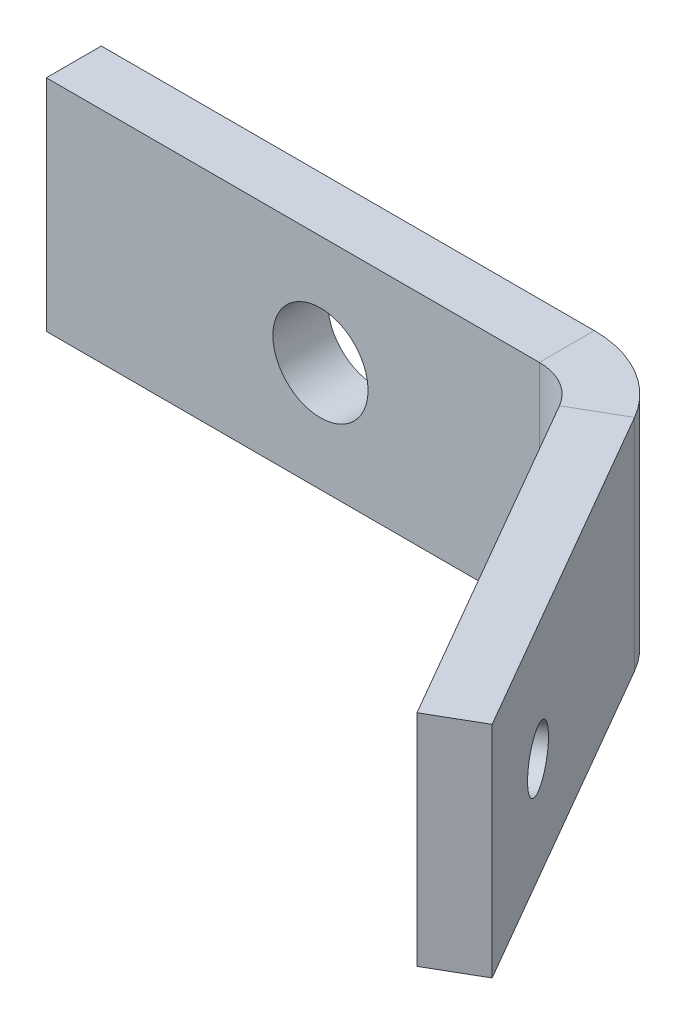
ISO-10303-21;
HEADER;
FILE_DESCRIPTION(('STEP AP214'),'2;1');
FILE_NAME('part.step','',(''),(''),'','','');
FILE_SCHEMA(('AUTOMOTIVE_DESIGN { 1 0 10303 214 1 1 1 1 }'));
ENDSEC;
DATA;
#1=APPLICATION_CONTEXT('core data for automotive mechanical design processes');
#2=APPLICATION_PROTOCOL_DEFINITION('international standard','automotive_design',2000,#1);
#3=PRODUCT_CONTEXT('',#1,'mechanical');
#4=PRODUCT('Part','Part','',(#3));
#5=PRODUCT_RELATED_PRODUCT_CATEGORY('part','',(#4));
#6=PRODUCT_DEFINITION_FORMATION('','',#4);
#7=PRODUCT_DEFINITION_CONTEXT('part definition',#1,'design');
#8=PRODUCT_DEFINITION('design','',#6,#7);
#9=PRODUCT_DEFINITION_SHAPE('','',#8);
#10=(LENGTH_UNIT() NAMED_UNIT(*) SI_UNIT(.MILLI.,.METRE.));
#11=(NAMED_UNIT(*) PLANE_ANGLE_UNIT() SI_UNIT($,.RADIAN.));
#12=(NAMED_UNIT(*) SI_UNIT($,.STERADIAN.) SOLID_ANGLE_UNIT());
#13=UNCERTAINTY_MEASURE_WITH_UNIT(LENGTH_MEASURE(1.E-05),#10,'distance_accuracy_value','');
#14=(GEOMETRIC_REPRESENTATION_CONTEXT(3) GLOBAL_UNCERTAINTY_ASSIGNED_CONTEXT((#13)) GLOBAL_UNIT_ASSIGNED_CONTEXT((#10,
#11,#12)) REPRESENTATION_CONTEXT('',''));
#15=CARTESIAN_POINT('',(0.,0.,0.));
#16=DIRECTION('',(0.,0.,1.));
#17=DIRECTION('',(1.,0.,0.));
#18=AXIS2_PLACEMENT_3D('',#15,#16,#17);
#19=CARTESIAN_POINT('',(0.507611544628694,0.,-3.17103195320263));
#20=DIRECTION('',(0.86602540378444,0.,-0.499999999999998));
#21=DIRECTION('',(-0.499999999999998,0.,-0.86602540378444));
#22=AXIS2_PLACEMENT_3D('',#19,#20,#21);
#23=PLANE('',#22);
#24=CARTESIAN_POINT('',(10.8826115446287,-0.329999999999999,14.7989951753245));
#25=DIRECTION('',(-0.86602540378444,0.,0.499999999999998));
#26=DIRECTION('',(0.499999999999998,0.,0.86602540378444));
#27=AXIS2_PLACEMENT_3D('',#24,#25,#26);
#28=CIRCLE('',#27,1.65000000000001);
#29=CARTESIAN_POINT('',(11.7076115446287,-0.329999999999999,16.2279370915688));
#30=VERTEX_POINT('',#29);
#31=EDGE_CURVE('E198',#30,#30,#28,.T.);
#32=ORIENTED_EDGE('',*,*,#31,.F.);
#33=EDGE_LOOP('',(#32));
#34=FACE_BOUND('',#33,.T.);
#35=DIRECTION('',(-0.499999999999998,0.,-0.86602540378444));
#36=VECTOR('',#35,1.);
#37=CARTESIAN_POINT('',(14.5076115446286,6.35,21.0776793527617));
#38=LINE('',#37,#36);
#39=CARTESIAN_POINT('',(14.5076115446286,6.35,21.0776793527617));
#40=VERTEX_POINT('',#39);
#41=CARTESIAN_POINT('',(3.25639462443063,6.35,1.59000000000001));
#42=VERTEX_POINT('',#41);
#43=EDGE_CURVE('E71',#40,#42,#38,.T.);
#44=ORIENTED_EDGE('',*,*,#43,.T.);
#45=DIRECTION('',(0.,-1.,0.));
#46=VECTOR('',#45,1.);
#47=CARTESIAN_POINT('',(3.25639462443063,0.,1.59));
#48=LINE('',#47,#46);
#49=CARTESIAN_POINT('',(3.25639462443063,-6.35,1.59000000000001));
#50=VERTEX_POINT('',#49);
#51=EDGE_CURVE('E63',#42,#50,#48,.T.);
#52=ORIENTED_EDGE('',*,*,#51,.T.);
#53=DIRECTION('',(0.499999999999998,0.,0.86602540378444));
#54=VECTOR('',#53,1.);
#55=CARTESIAN_POINT('',(14.5076115446286,-6.35,21.0776793527617));
#56=LINE('',#55,#54);
#57=CARTESIAN_POINT('',(14.5076115446286,-6.35,21.0776793527617));
#58=VERTEX_POINT('',#57);
#59=EDGE_CURVE('E79',#50,#58,#56,.T.);
#60=ORIENTED_EDGE('',*,*,#59,.T.);
#61=DIRECTION('',(0.,1.,0.));
#62=VECTOR('',#61,1.);
#63=CARTESIAN_POINT('',(14.5076115446286,6.35,21.0776793527617));
#64=LINE('',#63,#62);
#65=EDGE_CURVE('E170',#58,#40,#64,.T.);
#66=ORIENTED_EDGE('',*,*,#65,.T.);
#67=EDGE_LOOP('',(#44,#52,#60,#66));
#68=FACE_BOUND('',#67,.T.);
#69=ADVANCED_FACE('F54',(#34,#68),#23,.F.);
#70=CARTESIAN_POINT('',(17.2615723286632,6.35,19.4876793527617));
#71=DIRECTION('',(0.,1.,0.));
#72=DIRECTION('',(-0.499999999999998,0.,-0.86602540378444));
#73=AXIS2_PLACEMENT_3D('',#70,#71,#72);
#74=PLANE('',#73);
#75=DIRECTION('',(0.86602540378444,0.,-0.499999999999998));
#76=VECTOR('',#75,1.);
#77=CARTESIAN_POINT('',(6.01035540846515,6.35,0.));
#78=LINE('',#77,#76);
#79=CARTESIAN_POINT('',(6.01035540846515,6.35,0.));
#80=VERTEX_POINT('',#79);
#81=EDGE_CURVE('E14',#42,#80,#78,.T.);
#82=ORIENTED_EDGE('',*,*,#81,.F.);
#83=ORIENTED_EDGE('',*,*,#43,.F.);
#84=DIRECTION('',(-0.86602540378444,0.,0.499999999999998));
#85=VECTOR('',#84,1.);
#86=CARTESIAN_POINT('',(17.2615723286632,6.35,19.4876793527617));
#87=LINE('',#86,#85);
#88=CARTESIAN_POINT('',(17.2615723286632,6.35,19.4876793527617));
#89=VERTEX_POINT('',#88);
#90=EDGE_CURVE('E172',#89,#40,#87,.T.);
#91=ORIENTED_EDGE('',*,*,#90,.F.);
#92=DIRECTION('',(-0.499999999999998,0.,-0.86602540378444));
#93=VECTOR('',#92,1.);
#94=CARTESIAN_POINT('',(17.2615723286632,6.35,19.4876793527617));
#95=LINE('',#94,#93);
#96=EDGE_CURVE('E168',#89,#80,#95,.T.);
#97=ORIENTED_EDGE('',*,*,#96,.T.);
#98=EDGE_LOOP('',(#82,#83,#91,#97));
#99=FACE_BOUND('',#98,.T.);
#100=ADVANCED_FACE('F56',(#99),#74,.T.);
#101=CARTESIAN_POINT('',(17.2615723286632,6.35,19.4876793527617));
#102=DIRECTION('',(0.499999999999998,0.,0.86602540378444));
#103=DIRECTION('',(0.86602540378444,0.,-0.499999999999998));
#104=AXIS2_PLACEMENT_3D('',#101,#102,#103);
#105=PLANE('',#104);
#106=ORIENTED_EDGE('',*,*,#65,.F.);
#107=DIRECTION('',(-0.86602540378444,0.,0.499999999999998));
#108=VECTOR('',#107,1.);
#109=CARTESIAN_POINT('',(17.2615723286632,-6.35,19.4876793527617));
#110=LINE('',#109,#108);
#111=CARTESIAN_POINT('',(17.2615723286632,-6.35,19.4876793527617));
#112=VERTEX_POINT('',#111);
#113=EDGE_CURVE('E174',#112,#58,#110,.T.);
#114=ORIENTED_EDGE('',*,*,#113,.F.);
#115=DIRECTION('',(0.,1.,0.));
#116=VECTOR('',#115,1.);
#117=CARTESIAN_POINT('',(17.2615723286632,6.35,19.4876793527617));
#118=LINE('',#117,#116);
#119=EDGE_CURVE('E165',#112,#89,#118,.T.);
#120=ORIENTED_EDGE('',*,*,#119,.T.);
#121=ORIENTED_EDGE('',*,*,#90,.T.);
#122=EDGE_LOOP('',(#106,#114,#120,#121));
#123=FACE_BOUND('',#122,.T.);
#124=ADVANCED_FACE('F241',(#123),#105,.T.);
#125=CARTESIAN_POINT('',(17.2615723286632,-6.35,19.4876793527617));
#126=DIRECTION('',(0.,-1.,0.));
#127=DIRECTION('',(0.499999999999998,0.,0.86602540378444));
#128=AXIS2_PLACEMENT_3D('',#125,#126,#127);
#129=PLANE('',#128);
#130=DIRECTION('',(-0.86602540378444,0.,0.499999999999998));
#131=VECTOR('',#130,1.);
#132=CARTESIAN_POINT('',(6.01035540846515,-6.35,0.));
#133=LINE('',#132,#131);
#134=CARTESIAN_POINT('',(6.01035540846515,-6.35,0.));
#135=VERTEX_POINT('',#134);
#136=EDGE_CURVE('E177',#135,#50,#133,.T.);
#137=ORIENTED_EDGE('',*,*,#136,.F.);
#138=DIRECTION('',(0.499999999999998,0.,0.86602540378444));
#139=VECTOR('',#138,1.);
#140=CARTESIAN_POINT('',(17.2615723286632,-6.35,19.4876793527617));
#141=LINE('',#140,#139);
#142=EDGE_CURVE('E169',#135,#112,#141,.T.);
#143=ORIENTED_EDGE('',*,*,#142,.T.);
#144=ORIENTED_EDGE('',*,*,#113,.T.);
#145=ORIENTED_EDGE('',*,*,#59,.F.);
#146=EDGE_LOOP('',(#137,#143,#144,#145));
#147=FACE_BOUND('',#146,.T.);
#148=ADVANCED_FACE('F232',(#147),#129,.T.);
#149=CARTESIAN_POINT('',(3.26157232866321,0.,-4.76103195320262));
#150=DIRECTION('',(0.86602540378444,0.,-0.499999999999998));
#151=DIRECTION('',(-0.499999999999998,0.,-0.86602540378444));
#152=AXIS2_PLACEMENT_3D('',#149,#150,#151);
#153=PLANE('',#152);
#154=CARTESIAN_POINT('',(13.6365723286632,-0.329999999999999,13.2089951753245));
#155=DIRECTION('',(0.86602540378444,0.,-0.499999999999998));
#156=DIRECTION('',(-0.499999999999998,0.,-0.86602540378444));
#157=AXIS2_PLACEMENT_3D('',#154,#155,#156);
#158=CIRCLE('',#157,1.65000000000001);
#159=CARTESIAN_POINT('',(12.8115723286632,-0.329999999999999,11.7800532590802));
#160=VERTEX_POINT('',#159);
#161=EDGE_CURVE('E58',#160,#160,#158,.T.);
#162=ORIENTED_EDGE('',*,*,#161,.F.);
#163=EDGE_LOOP('',(#162));
#164=FACE_BOUND('',#163,.T.);
#165=DIRECTION('',(0.,-1.,0.));
#166=VECTOR('',#165,1.);
#167=CARTESIAN_POINT('',(6.01035540846515,0.,0.));
#168=LINE('',#167,#166);
#169=EDGE_CURVE('E143',#80,#135,#168,.T.);
#170=ORIENTED_EDGE('',*,*,#169,.F.);
#171=ORIENTED_EDGE('',*,*,#96,.F.);
#172=ORIENTED_EDGE('',*,*,#119,.F.);
#173=ORIENTED_EDGE('',*,*,#142,.F.);
#174=EDGE_LOOP('',(#170,#171,#172,#173));
#175=FACE_BOUND('',#174,.T.);
#176=ADVANCED_FACE('F224',(#164,#175),#153,.T.);
#177=CARTESIAN_POINT('',(-28.,6.35,-3.18));
#178=DIRECTION('',(-1.,0.,0.));
#179=DIRECTION('',(0.,0.,1.));
#180=AXIS2_PLACEMENT_3D('',#177,#178,#179);
#181=PLANE('',#180);
#182=DIRECTION('',(0.,-1.,0.));
#183=VECTOR('',#182,1.);
#184=CARTESIAN_POINT('',(-28.,6.35,0.));
#185=LINE('',#184,#183);
#186=CARTESIAN_POINT('',(-28.,6.35,0.));
#187=VERTEX_POINT('',#186);
#188=CARTESIAN_POINT('',(-28.,-6.35,0.));
#189=VERTEX_POINT('',#188);
#190=EDGE_CURVE('E211',#187,#189,#185,.T.);
#191=ORIENTED_EDGE('',*,*,#190,.F.);
#192=DIRECTION('',(0.,0.,1.));
#193=VECTOR('',#192,1.);
#194=CARTESIAN_POINT('',(-28.,6.35,-3.18));
#195=LINE('',#194,#193);
#196=CARTESIAN_POINT('',(-28.,6.35,-3.18));
#197=VERTEX_POINT('',#196);
#198=EDGE_CURVE('E183',#197,#187,#195,.T.);
#199=ORIENTED_EDGE('',*,*,#198,.F.);
#200=DIRECTION('',(0.,-1.,0.));
#201=VECTOR('',#200,1.);
#202=CARTESIAN_POINT('',(-28.,6.35,-3.18));
#203=LINE('',#202,#201);
#204=CARTESIAN_POINT('',(-28.,-6.35,-3.18));
#205=VERTEX_POINT('',#204);
#206=EDGE_CURVE('E162',#197,#205,#203,.T.);
#207=ORIENTED_EDGE('',*,*,#206,.T.);
#208=DIRECTION('',(0.,0.,1.));
#209=VECTOR('',#208,1.);
#210=CARTESIAN_POINT('',(-28.,-6.35,-3.18));
#211=LINE('',#210,#209);
#212=EDGE_CURVE('E155',#205,#189,#211,.T.);
#213=ORIENTED_EDGE('',*,*,#212,.T.);
#214=EDGE_LOOP('',(#191,#199,#207,#213));
#215=FACE_BOUND('',#214,.T.);
#216=ADVANCED_FACE('F222',(#215),#181,.T.);
#217=CARTESIAN_POINT('',(0.,0.,-3.18));
#218=DIRECTION('',(0.,0.,-1.));
#219=DIRECTION('',(-1.,0.,0.));
#220=AXIS2_PLACEMENT_3D('',#217,#218,#219);
#221=PLANE('',#220);
#222=CARTESIAN_POINT('',(-12.1509062476857,0.,-3.18));
#223=DIRECTION('',(0.,0.,-1.));
#224=DIRECTION('',(-1.,0.,0.));
#225=AXIS2_PLACEMENT_3D('',#222,#223,#224);
#226=CIRCLE('',#225,2.74999999956231);
#227=CARTESIAN_POINT('',(-14.900906247248,0.,-3.18));
#228=VERTEX_POINT('',#227);
#229=EDGE_CURVE('E188',#228,#228,#226,.T.);
#230=ORIENTED_EDGE('',*,*,#229,.F.);
#231=EDGE_LOOP('',(#230));
#232=FACE_BOUND('',#231,.T.);
#233=DIRECTION('',(-1.,0.,0.));
#234=VECTOR('',#233,1.);
#235=CARTESIAN_POINT('',(28.,6.35,-3.18));
#236=LINE('',#235,#234);
#237=CARTESIAN_POINT('',(0.502433840396107,6.35,-3.18));
#238=VERTEX_POINT('',#237);
#239=EDGE_CURVE('E153',#238,#197,#236,.T.);
#240=ORIENTED_EDGE('',*,*,#239,.F.);
#241=DIRECTION('',(0.,-1.,0.));
#242=VECTOR('',#241,1.);
#243=CARTESIAN_POINT('',(0.502433840396108,0.,-3.18));
#244=LINE('',#243,#242);
#245=CARTESIAN_POINT('',(0.502433840396107,-6.35,-3.18));
#246=VERTEX_POINT('',#245);
#247=EDGE_CURVE('E141',#238,#246,#244,.T.);
#248=ORIENTED_EDGE('',*,*,#247,.T.);
#249=DIRECTION('',(1.,0.,0.));
#250=VECTOR('',#249,1.);
#251=CARTESIAN_POINT('',(28.,-6.35,-3.18));
#252=LINE('',#251,#250);
#253=EDGE_CURVE('E134',#205,#246,#252,.T.);
#254=ORIENTED_EDGE('',*,*,#253,.F.);
#255=ORIENTED_EDGE('',*,*,#206,.F.);
#256=EDGE_LOOP('',(#240,#248,#254,#255));
#257=FACE_BOUND('',#256,.T.);
#258=ADVANCED_FACE('F150',(#232,#257),#221,.T.);
#259=CARTESIAN_POINT('',(28.,-6.35,-3.18));
#260=DIRECTION('',(0.,-1.,0.));
#261=DIRECTION('',(1.,0.,0.));
#262=AXIS2_PLACEMENT_3D('',#259,#260,#261);
#263=PLANE('',#262);
#264=ORIENTED_EDGE('',*,*,#253,.T.);
#265=DIRECTION('',(0.,0.,1.));
#266=VECTOR('',#265,1.);
#267=CARTESIAN_POINT('',(0.502433840396107,-6.35,-3.18));
#268=LINE('',#267,#266);
#269=CARTESIAN_POINT('',(0.502433840396107,-6.35,0.));
#270=VERTEX_POINT('',#269);
#271=EDGE_CURVE('E122',#246,#270,#268,.T.);
#272=ORIENTED_EDGE('',*,*,#271,.T.);
#273=DIRECTION('',(1.,0.,0.));
#274=VECTOR('',#273,1.);
#275=CARTESIAN_POINT('',(28.,-6.35,0.));
#276=LINE('',#275,#274);
#277=EDGE_CURVE('E208',#189,#270,#276,.T.);
#278=ORIENTED_EDGE('',*,*,#277,.F.);
#279=ORIENTED_EDGE('',*,*,#212,.F.);
#280=EDGE_LOOP('',(#264,#272,#278,#279));
#281=FACE_BOUND('',#280,.T.);
#282=ADVANCED_FACE('F157',(#281),#263,.T.);
#283=CARTESIAN_POINT('',(0.,0.,0.));
#284=DIRECTION('',(0.,0.,-1.));
#285=DIRECTION('',(-1.,0.,0.));
#286=AXIS2_PLACEMENT_3D('',#283,#284,#285);
#287=PLANE('',#286);
#288=CARTESIAN_POINT('',(-12.1509062476857,0.,0.));
#289=DIRECTION('',(0.,0.,-1.));
#290=DIRECTION('',(-1.,0.,0.));
#291=AXIS2_PLACEMENT_3D('',#288,#289,#290);
#292=CIRCLE('',#291,2.74999999956231);
#293=CARTESIAN_POINT('',(-14.900906247248,0.,0.));
#294=VERTEX_POINT('',#293);
#295=EDGE_CURVE('E185',#294,#294,#292,.T.);
#296=ORIENTED_EDGE('',*,*,#295,.T.);
#297=EDGE_LOOP('',(#296));
#298=FACE_BOUND('',#297,.T.);
#299=DIRECTION('',(0.,-1.,0.));
#300=VECTOR('',#299,1.);
#301=CARTESIAN_POINT('',(0.502433840396108,0.,0.));
#302=LINE('',#301,#300);
#303=CARTESIAN_POINT('',(0.502433840396108,6.35,0.));
#304=VERTEX_POINT('',#303);
#305=EDGE_CURVE('E144',#304,#270,#302,.T.);
#306=ORIENTED_EDGE('',*,*,#305,.F.);
#307=DIRECTION('',(-1.,0.,0.));
#308=VECTOR('',#307,1.);
#309=CARTESIAN_POINT('',(28.,6.35,0.));
#310=LINE('',#309,#308);
#311=EDGE_CURVE('E133',#304,#187,#310,.T.);
#312=ORIENTED_EDGE('',*,*,#311,.T.);
#313=ORIENTED_EDGE('',*,*,#190,.T.);
#314=ORIENTED_EDGE('',*,*,#277,.T.);
#315=EDGE_LOOP('',(#306,#312,#313,#314));
#316=FACE_BOUND('',#315,.T.);
#317=ADVANCED_FACE('F216',(#298,#316),#287,.F.);
#318=CARTESIAN_POINT('',(28.,6.35,-3.18));
#319=DIRECTION('',(0.,1.,0.));
#320=DIRECTION('',(-1.,0.,0.));
#321=AXIS2_PLACEMENT_3D('',#318,#319,#320);
#322=PLANE('',#321);
#323=ORIENTED_EDGE('',*,*,#311,.F.);
#324=DIRECTION('',(0.,0.,-1.));
#325=VECTOR('',#324,1.);
#326=CARTESIAN_POINT('',(0.502433840396107,6.35,-3.18));
#327=LINE('',#326,#325);
#328=EDGE_CURVE('E206',#304,#238,#327,.T.);
#329=ORIENTED_EDGE('',*,*,#328,.T.);
#330=ORIENTED_EDGE('',*,*,#239,.T.);
#331=ORIENTED_EDGE('',*,*,#198,.T.);
#332=EDGE_LOOP('',(#323,#329,#330,#331));
#333=FACE_BOUND('',#332,.T.);
#334=ADVANCED_FACE('F220',(#333),#322,.T.);
#335=CARTESIAN_POINT('',(0.502433840396108,6.35,3.18));
#336=DIRECTION('',(0.,1.,0.));
#337=DIRECTION('',(0.,0.,1.));
#338=AXIS2_PLACEMENT_3D('',#335,#336,#337);
#339=PLANE('',#338);
#340=ORIENTED_EDGE('',*,*,#328,.F.);
#341=CARTESIAN_POINT('',(0.502433840396108,6.35,3.18));
#342=DIRECTION('',(0.,-1.,0.));
#343=DIRECTION('',(0.,0.,-1.));
#344=AXIS2_PLACEMENT_3D('',#341,#342,#343);
#345=CIRCLE('',#344,3.18);
#346=EDGE_CURVE('E187',#304,#42,#345,.T.);
#347=ORIENTED_EDGE('',*,*,#346,.T.);
#348=ORIENTED_EDGE('',*,*,#81,.T.);
#349=CARTESIAN_POINT('',(0.502433840396108,6.35,3.18));
#350=DIRECTION('',(0.,-1.,0.));
#351=DIRECTION('',(0.,0.,1.));
#352=AXIS2_PLACEMENT_3D('',#349,#350,#351);
#353=CIRCLE('',#352,6.36);
#354=EDGE_CURVE('E145',#238,#80,#353,.T.);
#355=ORIENTED_EDGE('',*,*,#354,.F.);
#356=EDGE_LOOP('',(#340,#347,#348,#355));
#357=FACE_BOUND('',#356,.T.);
#358=ADVANCED_FACE('F252',(#357),#339,.T.);
#359=CARTESIAN_POINT('',(0.502433840396108,-6.35,3.18));
#360=DIRECTION('',(0.,-1.,0.));
#361=DIRECTION('',(0.,0.,-1.));
#362=AXIS2_PLACEMENT_3D('',#359,#360,#361);
#363=PLANE('',#362);
#364=CARTESIAN_POINT('',(0.502433840396108,-6.35,3.18));
#365=DIRECTION('',(0.,-1.,0.));
#366=DIRECTION('',(0.,0.,-1.));
#367=AXIS2_PLACEMENT_3D('',#364,#365,#366);
#368=CIRCLE('',#367,3.18);
#369=EDGE_CURVE('E128',#50,#270,#368,.F.);
#370=ORIENTED_EDGE('',*,*,#369,.T.);
#371=ORIENTED_EDGE('',*,*,#271,.F.);
#372=CARTESIAN_POINT('',(0.502433840396108,-6.35,3.18));
#373=DIRECTION('',(0.,1.,0.));
#374=DIRECTION('',(0.,0.,-1.));
#375=AXIS2_PLACEMENT_3D('',#372,#373,#374);
#376=CIRCLE('',#375,6.36);
#377=EDGE_CURVE('E126',#135,#246,#376,.T.);
#378=ORIENTED_EDGE('',*,*,#377,.F.);
#379=ORIENTED_EDGE('',*,*,#136,.T.);
#380=EDGE_LOOP('',(#370,#371,#378,#379));
#381=FACE_BOUND('',#380,.T.);
#382=ADVANCED_FACE('F124',(#381),#363,.T.);
#383=CARTESIAN_POINT('',(0.502433840396108,14.0126281220331,3.18));
#384=DIRECTION('',(0.,-1.,0.));
#385=DIRECTION('',(0.,0.,-1.));
#386=AXIS2_PLACEMENT_3D('',#383,#384,#385);
#387=CYLINDRICAL_SURFACE('',#386,6.36);
#388=ORIENTED_EDGE('',*,*,#169,.T.);
#389=ORIENTED_EDGE('',*,*,#377,.T.);
#390=ORIENTED_EDGE('',*,*,#247,.F.);
#391=ORIENTED_EDGE('',*,*,#354,.T.);
#392=EDGE_LOOP('',(#388,#389,#390,#391));
#393=FACE_BOUND('',#392,.T.);
#394=ADVANCED_FACE('F139',(#393),#387,.T.);
#395=CARTESIAN_POINT('',(0.502433840396108,14.0126281220331,3.18));
#396=DIRECTION('',(0.,-1.,0.));
#397=DIRECTION('',(0.,0.,-1.));
#398=AXIS2_PLACEMENT_3D('',#395,#396,#397);
#399=CYLINDRICAL_SURFACE('',#398,3.18);
#400=ORIENTED_EDGE('',*,*,#51,.F.);
#401=ORIENTED_EDGE('',*,*,#346,.F.);
#402=ORIENTED_EDGE('',*,*,#305,.T.);
#403=ORIENTED_EDGE('',*,*,#369,.F.);
#404=EDGE_LOOP('',(#400,#401,#402,#403));
#405=FACE_BOUND('',#404,.T.);
#406=ADVANCED_FACE('F287',(#405),#399,.F.);
#407=CARTESIAN_POINT('',(-12.1509062476857,0.,6.82));
#408=DIRECTION('',(0.,0.,-1.));
#409=DIRECTION('',(-1.,0.,0.));
#410=AXIS2_PLACEMENT_3D('',#407,#408,#409);
#411=CYLINDRICAL_SURFACE('',#410,2.74999999956231);
#412=ORIENTED_EDGE('',*,*,#229,.T.);
#413=EDGE_LOOP('',(#412));
#414=FACE_BOUND('',#413,.T.);
#415=ORIENTED_EDGE('',*,*,#295,.F.);
#416=EDGE_LOOP('',(#415));
#417=FACE_BOUND('',#416,.T.);
#418=ADVANCED_FACE('F294',(#414,#417),#411,.F.);
#419=CARTESIAN_POINT('',(19.542865582473,-0.329999999999999,9.79899517532452));
#420=DIRECTION('',(-0.86602540378444,0.,0.499999999999998));
#421=DIRECTION('',(0.499999999999998,0.,0.86602540378444));
#422=AXIS2_PLACEMENT_3D('',#419,#420,#421);
#423=CYLINDRICAL_SURFACE('',#422,1.65000000000001);
#424=ORIENTED_EDGE('',*,*,#161,.T.);
#425=EDGE_LOOP('',(#424));
#426=FACE_BOUND('',#425,.T.);
#427=ORIENTED_EDGE('',*,*,#31,.T.);
#428=EDGE_LOOP('',(#427));
#429=FACE_BOUND('',#428,.T.);
#430=ADVANCED_FACE('F301',(#426,#429),#423,.F.);
#431=CLOSED_SHELL('',(#69,#100,#124,#148,#176,#216,#258,#282,#317,#334,#358,#382,#394,#406,#418,#430));
#432=MANIFOLD_SOLID_BREP('B2',#431);
#433=ADVANCED_BREP_SHAPE_REPRESENTATION('',(#18,#432),#14);
#434=SHAPE_DEFINITION_REPRESENTATION(#9,#433);
ENDSEC;
END-ISO-10303-21;
